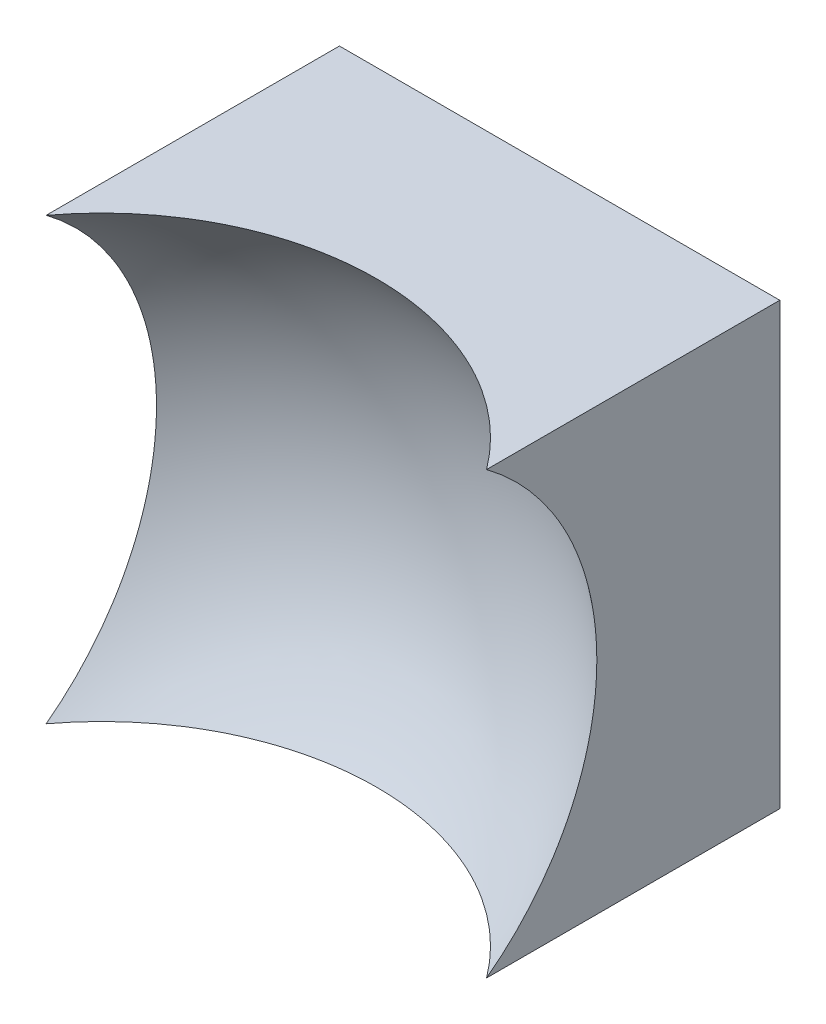
ISO-10303-21;
HEADER;
FILE_DESCRIPTION(('STEP AP214'),'2;1');
FILE_NAME('part.step','',(''),(''),'','','');
FILE_SCHEMA(('AUTOMOTIVE_DESIGN { 1 0 10303 214 1 1 1 1 }'));
ENDSEC;
DATA;
#1=APPLICATION_CONTEXT('core data for automotive mechanical design processes');
#2=APPLICATION_PROTOCOL_DEFINITION('international standard','automotive_design',2000,#1);
#3=PRODUCT_CONTEXT('',#1,'mechanical');
#4=PRODUCT('Part','Part','',(#3));
#5=PRODUCT_RELATED_PRODUCT_CATEGORY('part','',(#4));
#6=PRODUCT_DEFINITION_FORMATION('','',#4);
#7=PRODUCT_DEFINITION_CONTEXT('part definition',#1,'design');
#8=PRODUCT_DEFINITION('design','',#6,#7);
#9=PRODUCT_DEFINITION_SHAPE('','',#8);
#10=(LENGTH_UNIT() NAMED_UNIT(*) SI_UNIT(.MILLI.,.METRE.));
#11=(NAMED_UNIT(*) PLANE_ANGLE_UNIT() SI_UNIT($,.RADIAN.));
#12=(NAMED_UNIT(*) SI_UNIT($,.STERADIAN.) SOLID_ANGLE_UNIT());
#13=UNCERTAINTY_MEASURE_WITH_UNIT(LENGTH_MEASURE(1.E-05),#10,'distance_accuracy_value','');
#14=(GEOMETRIC_REPRESENTATION_CONTEXT(3) GLOBAL_UNCERTAINTY_ASSIGNED_CONTEXT((#13)) GLOBAL_UNIT_ASSIGNED_CONTEXT((#10,
#11,#12)) REPRESENTATION_CONTEXT('',''));
#15=CARTESIAN_POINT('',(0.,0.,0.));
#16=DIRECTION('',(0.,0.,1.));
#17=DIRECTION('',(1.,0.,0.));
#18=AXIS2_PLACEMENT_3D('',#15,#16,#17);
#19=CARTESIAN_POINT('',(-6.25,6.25,10.));
#20=DIRECTION('',(0.,1.,0.));
#21=DIRECTION('',(0.,0.,1.));
#22=AXIS2_PLACEMENT_3D('',#19,#20,#21);
#23=PLANE('',#22);
#24=CARTESIAN_POINT('',(0.,6.25,13.));
#25=DIRECTION('',(0.,1.,0.));
#26=DIRECTION('',(0.,0.,1.));
#27=AXIS2_PLACEMENT_3D('',#24,#25,#26);
#28=CIRCLE('',#27,7.806247497998);
#29=CARTESIAN_POINT('',(6.25,6.25,8.32292826653257));
#30=VERTEX_POINT('',#29);
#31=CARTESIAN_POINT('',(-6.25,6.25,8.32292826653257));
#32=VERTEX_POINT('',#31);
#33=EDGE_CURVE('E79',#30,#32,#28,.T.);
#34=ORIENTED_EDGE('',*,*,#33,.F.);
#35=DIRECTION('',(0.,0.,-1.));
#36=VECTOR('',#35,1.);
#37=CARTESIAN_POINT('',(6.25,6.25,10.));
#38=LINE('',#37,#36);
#39=CARTESIAN_POINT('',(6.25,6.25,0.));
#40=VERTEX_POINT('',#39);
#41=EDGE_CURVE('E85',#30,#40,#38,.T.);
#42=ORIENTED_EDGE('',*,*,#41,.T.);
#43=DIRECTION('',(1.,0.,0.));
#44=VECTOR('',#43,1.);
#45=CARTESIAN_POINT('',(-6.25,6.25,0.));
#46=LINE('',#45,#44);
#47=CARTESIAN_POINT('',(-6.25,6.25,0.));
#48=VERTEX_POINT('',#47);
#49=EDGE_CURVE('E88',#48,#40,#46,.T.);
#50=ORIENTED_EDGE('',*,*,#49,.F.);
#51=DIRECTION('',(0.,0.,-1.));
#52=VECTOR('',#51,1.);
#53=CARTESIAN_POINT('',(-6.25,6.25,10.));
#54=LINE('',#53,#52);
#55=EDGE_CURVE('E47',#32,#48,#54,.T.);
#56=ORIENTED_EDGE('',*,*,#55,.F.);
#57=EDGE_LOOP('',(#34,#42,#50,#56));
#58=FACE_BOUND('',#57,.T.);
#59=ADVANCED_FACE('F39',(#58),#23,.T.);
#60=CARTESIAN_POINT('',(-6.25,6.25,10.));
#61=DIRECTION('',(1.,0.,0.));
#62=DIRECTION('',(0.,0.,-1.));
#63=AXIS2_PLACEMENT_3D('',#60,#61,#62);
#64=PLANE('',#63);
#65=DIRECTION('',(0.,0.,-1.));
#66=VECTOR('',#65,1.);
#67=CARTESIAN_POINT('',(-6.25,-6.25,10.));
#68=LINE('',#67,#66);
#69=CARTESIAN_POINT('',(-6.25,-6.25,8.32292826653257));
#70=VERTEX_POINT('',#69);
#71=CARTESIAN_POINT('',(-6.25,-6.25,0.));
#72=VERTEX_POINT('',#71);
#73=EDGE_CURVE('E100',#70,#72,#68,.T.);
#74=ORIENTED_EDGE('',*,*,#73,.F.);
#75=CARTESIAN_POINT('',(-6.25,0.,13.));
#76=DIRECTION('',(1.,0.,0.));
#77=DIRECTION('',(0.,0.,-1.));
#78=AXIS2_PLACEMENT_3D('',#75,#76,#77);
#79=CIRCLE('',#78,7.806247497998);
#80=EDGE_CURVE('E89',#70,#32,#79,.T.);
#81=ORIENTED_EDGE('',*,*,#80,.T.);
#82=ORIENTED_EDGE('',*,*,#55,.T.);
#83=DIRECTION('',(0.,-1.,0.));
#84=VECTOR('',#83,1.);
#85=CARTESIAN_POINT('',(-6.25,6.25,0.));
#86=LINE('',#85,#84);
#87=EDGE_CURVE('E97',#48,#72,#86,.T.);
#88=ORIENTED_EDGE('',*,*,#87,.T.);
#89=EDGE_LOOP('',(#74,#81,#82,#88));
#90=FACE_BOUND('',#89,.T.);
#91=ADVANCED_FACE('F122',(#90),#64,.F.);
#92=CARTESIAN_POINT('',(-6.25,-6.25,10.));
#93=DIRECTION('',(0.,1.,0.));
#94=DIRECTION('',(0.,0.,1.));
#95=AXIS2_PLACEMENT_3D('',#92,#93,#94);
#96=PLANE('',#95);
#97=DIRECTION('',(0.,0.,-1.));
#98=VECTOR('',#97,1.);
#99=CARTESIAN_POINT('',(6.25,-6.25,10.));
#100=LINE('',#99,#98);
#101=CARTESIAN_POINT('',(6.25,-6.25,8.32292826653257));
#102=VERTEX_POINT('',#101);
#103=CARTESIAN_POINT('',(6.25,-6.25,0.));
#104=VERTEX_POINT('',#103);
#105=EDGE_CURVE('E96',#102,#104,#100,.T.);
#106=ORIENTED_EDGE('',*,*,#105,.F.);
#107=CARTESIAN_POINT('',(0.,-6.25,13.));
#108=DIRECTION('',(0.,1.,0.));
#109=DIRECTION('',(0.,0.,1.));
#110=AXIS2_PLACEMENT_3D('',#107,#108,#109);
#111=CIRCLE('',#110,7.806247497998);
#112=EDGE_CURVE('E53',#102,#70,#111,.T.);
#113=ORIENTED_EDGE('',*,*,#112,.T.);
#114=ORIENTED_EDGE('',*,*,#73,.T.);
#115=DIRECTION('',(1.,0.,0.));
#116=VECTOR('',#115,1.);
#117=CARTESIAN_POINT('',(-6.25,-6.25,0.));
#118=LINE('',#117,#116);
#119=EDGE_CURVE('E102',#72,#104,#118,.T.);
#120=ORIENTED_EDGE('',*,*,#119,.T.);
#121=EDGE_LOOP('',(#106,#113,#114,#120));
#122=FACE_BOUND('',#121,.T.);
#123=ADVANCED_FACE('F121',(#122),#96,.F.);
#124=CARTESIAN_POINT('',(6.25,6.25,10.));
#125=DIRECTION('',(1.,0.,0.));
#126=DIRECTION('',(0.,0.,-1.));
#127=AXIS2_PLACEMENT_3D('',#124,#125,#126);
#128=PLANE('',#127);
#129=CARTESIAN_POINT('',(6.25,0.,13.));
#130=DIRECTION('',(1.,0.,0.));
#131=DIRECTION('',(0.,0.,-1.));
#132=AXIS2_PLACEMENT_3D('',#129,#130,#131);
#133=CIRCLE('',#132,7.806247497998);
#134=EDGE_CURVE('E11',#102,#30,#133,.T.);
#135=ORIENTED_EDGE('',*,*,#134,.F.);
#136=ORIENTED_EDGE('',*,*,#105,.T.);
#137=DIRECTION('',(0.,-1.,0.));
#138=VECTOR('',#137,1.);
#139=CARTESIAN_POINT('',(6.25,6.25,0.));
#140=LINE('',#139,#138);
#141=EDGE_CURVE('E93',#40,#104,#140,.T.);
#142=ORIENTED_EDGE('',*,*,#141,.F.);
#143=ORIENTED_EDGE('',*,*,#41,.F.);
#144=EDGE_LOOP('',(#135,#136,#142,#143));
#145=FACE_BOUND('',#144,.T.);
#146=ADVANCED_FACE('F91',(#145),#128,.T.);
#147=CARTESIAN_POINT('',(0.,0.,0.));
#148=DIRECTION('',(0.,0.,-1.));
#149=DIRECTION('',(-1.,0.,0.));
#150=AXIS2_PLACEMENT_3D('',#147,#148,#149);
#151=PLANE('',#150);
#152=ORIENTED_EDGE('',*,*,#49,.T.);
#153=ORIENTED_EDGE('',*,*,#141,.T.);
#154=ORIENTED_EDGE('',*,*,#119,.F.);
#155=ORIENTED_EDGE('',*,*,#87,.F.);
#156=EDGE_LOOP('',(#152,#153,#154,#155));
#157=FACE_BOUND('',#156,.T.);
#158=ADVANCED_FACE('F125',(#157),#151,.T.);
#159=CARTESIAN_POINT('',(0.,0.,13.));
#160=DIRECTION('',(0.,0.,1.));
#161=DIRECTION('',(1.,0.,0.));
#162=AXIS2_PLACEMENT_3D('',#159,#160,#161);
#163=SPHERICAL_SURFACE('',#162,10.);
#164=ORIENTED_EDGE('',*,*,#33,.T.);
#165=ORIENTED_EDGE('',*,*,#80,.F.);
#166=ORIENTED_EDGE('',*,*,#112,.F.);
#167=ORIENTED_EDGE('',*,*,#134,.T.);
#168=EDGE_LOOP('',(#164,#165,#166,#167));
#169=FACE_BOUND('',#168,.T.);
#170=ADVANCED_FACE('F78',(#169),#163,.F.);
#171=CLOSED_SHELL('',(#59,#91,#123,#146,#158,#170));
#172=MANIFOLD_SOLID_BREP('B2',#171);
#173=ADVANCED_BREP_SHAPE_REPRESENTATION('',(#18,#172),#14);
#174=SHAPE_DEFINITION_REPRESENTATION(#9,#173);
ENDSEC;
END-ISO-10303-21;
